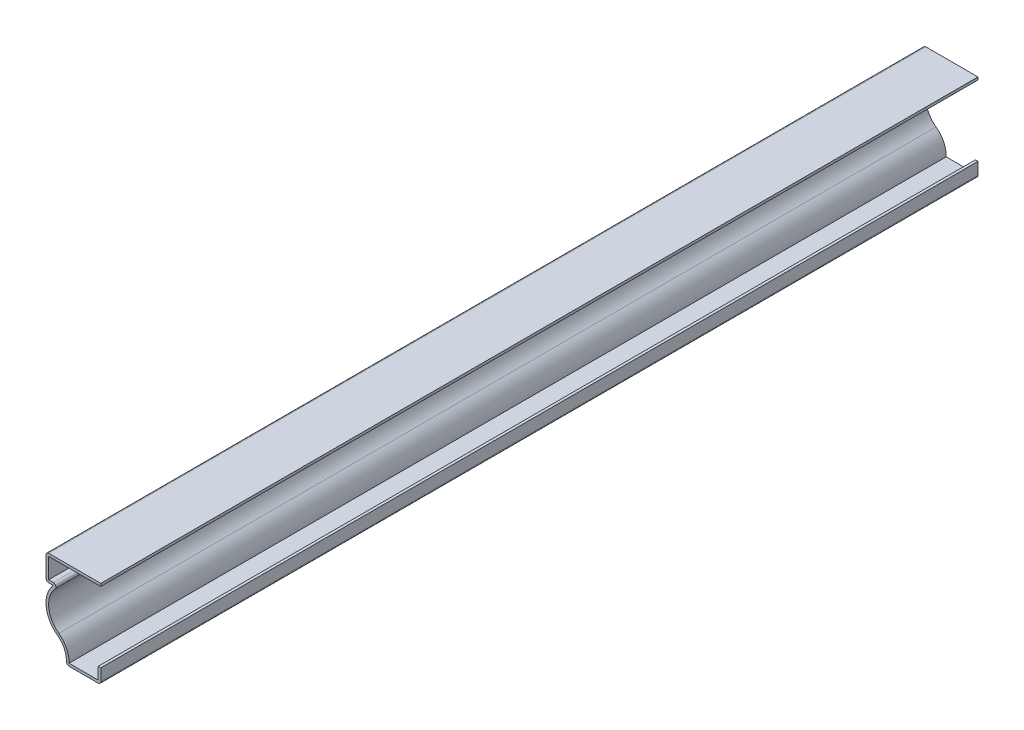
ISO-10303-21;
HEADER;
FILE_DESCRIPTION(('STEP AP214'),'2;1');
FILE_NAME('part.step','',(''),(''),'','','');
FILE_SCHEMA(('AUTOMOTIVE_DESIGN { 1 0 10303 214 1 1 1 1 }'));
ENDSEC;
DATA;
#1=APPLICATION_CONTEXT('core data for automotive mechanical design processes');
#2=APPLICATION_PROTOCOL_DEFINITION('international standard','automotive_design',2000,#1);
#3=PRODUCT_CONTEXT('',#1,'mechanical');
#4=PRODUCT('Part','Part','',(#3));
#5=PRODUCT_RELATED_PRODUCT_CATEGORY('part','',(#4));
#6=PRODUCT_DEFINITION_FORMATION('','',#4);
#7=PRODUCT_DEFINITION_CONTEXT('part definition',#1,'design');
#8=PRODUCT_DEFINITION('design','',#6,#7);
#9=PRODUCT_DEFINITION_SHAPE('','',#8);
#10=(LENGTH_UNIT() NAMED_UNIT(*) SI_UNIT(.MILLI.,.METRE.));
#11=(NAMED_UNIT(*) PLANE_ANGLE_UNIT() SI_UNIT($,.RADIAN.));
#12=(NAMED_UNIT(*) SI_UNIT($,.STERADIAN.) SOLID_ANGLE_UNIT());
#13=UNCERTAINTY_MEASURE_WITH_UNIT(LENGTH_MEASURE(1.E-05),#10,'distance_accuracy_value','');
#14=(GEOMETRIC_REPRESENTATION_CONTEXT(3) GLOBAL_UNCERTAINTY_ASSIGNED_CONTEXT((#13)) GLOBAL_UNIT_ASSIGNED_CONTEXT((#10,
#11,#12)) REPRESENTATION_CONTEXT('',''));
#15=CARTESIAN_POINT('',(0.,0.,0.));
#16=DIRECTION('',(0.,0.,1.));
#17=DIRECTION('',(1.,0.,0.));
#18=AXIS2_PLACEMENT_3D('',#15,#16,#17);
#19=CARTESIAN_POINT('',(-23.8125,36.957,-381.));
#20=DIRECTION('',(0.,-1.,0.));
#21=DIRECTION('',(0.,0.,-1.));
#22=AXIS2_PLACEMENT_3D('',#19,#20,#21);
#23=PLANE('',#22);
#24=DIRECTION('',(1.,0.,0.));
#25=VECTOR('',#24,1.);
#26=CARTESIAN_POINT('',(-23.8125,36.957,0.));
#27=LINE('',#26,#25);
#28=CARTESIAN_POINT('',(-22.6695,36.957,0.));
#29=VERTEX_POINT('',#28);
#30=CARTESIAN_POINT('',(0.,36.957,0.));
#31=VERTEX_POINT('',#30);
#32=EDGE_CURVE('E242',#29,#31,#27,.T.);
#33=ORIENTED_EDGE('',*,*,#32,.F.);
#34=DIRECTION('',(0.,0.,1.));
#35=VECTOR('',#34,1.);
#36=CARTESIAN_POINT('',(-22.6695,36.957,-381.));
#37=LINE('',#36,#35);
#38=CARTESIAN_POINT('',(-22.6695,36.957,-381.));
#39=VERTEX_POINT('',#38);
#40=EDGE_CURVE('E203',#39,#29,#37,.T.);
#41=ORIENTED_EDGE('',*,*,#40,.F.);
#42=DIRECTION('',(1.,0.,0.));
#43=VECTOR('',#42,1.);
#44=CARTESIAN_POINT('',(-23.8125,36.957,-381.));
#45=LINE('',#44,#43);
#46=CARTESIAN_POINT('',(0.,36.957,-381.));
#47=VERTEX_POINT('',#46);
#48=EDGE_CURVE('E185',#39,#47,#45,.T.);
#49=ORIENTED_EDGE('',*,*,#48,.T.);
#50=DIRECTION('',(0.,0.,1.));
#51=VECTOR('',#50,1.);
#52=CARTESIAN_POINT('',(0.,36.957,-381.));
#53=LINE('',#52,#51);
#54=EDGE_CURVE('E193',#47,#31,#53,.T.);
#55=ORIENTED_EDGE('',*,*,#54,.T.);
#56=EDGE_LOOP('',(#33,#41,#49,#55));
#57=FACE_BOUND('',#56,.T.);
#58=ADVANCED_FACE('F35',(#57),#23,.T.);
#59=CARTESIAN_POINT('',(-22.6695,26.9875,-381.));
#60=DIRECTION('',(1.,0.,0.));
#61=DIRECTION('',(0.,1.,0.));
#62=AXIS2_PLACEMENT_3D('',#59,#60,#61);
#63=PLANE('',#62);
#64=DIRECTION('',(0.,1.,0.));
#65=VECTOR('',#64,1.);
#66=CARTESIAN_POINT('',(-22.6695,26.9875,0.));
#67=LINE('',#66,#65);
#68=CARTESIAN_POINT('',(-22.6695,28.1305,0.));
#69=VERTEX_POINT('',#68);
#70=EDGE_CURVE('E204',#69,#29,#67,.T.);
#71=ORIENTED_EDGE('',*,*,#70,.F.);
#72=DIRECTION('',(0.,0.,1.));
#73=VECTOR('',#72,1.);
#74=CARTESIAN_POINT('',(-22.6695,28.1305,-381.));
#75=LINE('',#74,#73);
#76=CARTESIAN_POINT('',(-22.6695,28.1305,-381.));
#77=VERTEX_POINT('',#76);
#78=EDGE_CURVE('E279',#77,#69,#75,.T.);
#79=ORIENTED_EDGE('',*,*,#78,.F.);
#80=DIRECTION('',(0.,1.,0.));
#81=VECTOR('',#80,1.);
#82=CARTESIAN_POINT('',(-22.6695,26.9875,-381.));
#83=LINE('',#82,#81);
#84=EDGE_CURVE('E201',#77,#39,#83,.T.);
#85=ORIENTED_EDGE('',*,*,#84,.T.);
#86=ORIENTED_EDGE('',*,*,#40,.T.);
#87=EDGE_LOOP('',(#71,#79,#85,#86));
#88=FACE_BOUND('',#87,.T.);
#89=ADVANCED_FACE('F361',(#88),#63,.T.);
#90=CARTESIAN_POINT('',(-20.6375,28.1305,-381.));
#91=DIRECTION('',(0.,1.,0.));
#92=DIRECTION('',(0.,0.,1.));
#93=AXIS2_PLACEMENT_3D('',#90,#91,#92);
#94=PLANE('',#93);
#95=DIRECTION('',(1.,0.,0.));
#96=VECTOR('',#95,1.);
#97=CARTESIAN_POINT('',(-20.6375,28.1305,0.));
#98=LINE('',#97,#96);
#99=CARTESIAN_POINT('',(-20.6375,28.1305,0.));
#100=VERTEX_POINT('',#99);
#101=EDGE_CURVE('E207',#100,#69,#98,.F.);
#102=ORIENTED_EDGE('',*,*,#101,.F.);
#103=DIRECTION('',(0.,0.,1.));
#104=VECTOR('',#103,1.);
#105=CARTESIAN_POINT('',(-20.6375,28.1305,-381.));
#106=LINE('',#105,#104);
#107=CARTESIAN_POINT('',(-20.6375,28.1305,-381.));
#108=VERTEX_POINT('',#107);
#109=EDGE_CURVE('E331',#100,#108,#106,.F.);
#110=ORIENTED_EDGE('',*,*,#109,.T.);
#111=DIRECTION('',(1.,0.,0.));
#112=VECTOR('',#111,1.);
#113=CARTESIAN_POINT('',(-20.6375,28.1305,-381.));
#114=LINE('',#113,#112);
#115=EDGE_CURVE('E239',#108,#77,#114,.F.);
#116=ORIENTED_EDGE('',*,*,#115,.T.);
#117=ORIENTED_EDGE('',*,*,#78,.T.);
#118=EDGE_LOOP('',(#102,#110,#116,#117));
#119=FACE_BOUND('',#118,.T.);
#120=ADVANCED_FACE('F428',(#119),#94,.T.);
#121=CARTESIAN_POINT('',(-11.90625,18.8928065221714,-381.));
#122=DIRECTION('',(0.,0.,1.));
#123=DIRECTION('',(1.,0.,0.));
#124=AXIS2_PLACEMENT_3D('',#121,#122,#123);
#125=CYLINDRICAL_SURFACE('',#124,10.76325);
#126=CARTESIAN_POINT('',(-11.90625,18.8928065221714,-381.));
#127=DIRECTION('',(0.,0.,1.));
#128=DIRECTION('',(1.,0.,0.));
#129=AXIS2_PLACEMENT_3D('',#126,#127,#128);
#130=CIRCLE('',#129,10.76325);
#131=CARTESIAN_POINT('',(-18.2216533434014,10.1771177270931,-381.));
#132=VERTEX_POINT('',#131);
#133=CARTESIAN_POINT('',(-19.7993,26.2104094261285,-381.));
#134=VERTEX_POINT('',#133);
#135=EDGE_CURVE('E236',#132,#134,#130,.F.);
#136=ORIENTED_EDGE('',*,*,#135,.T.);
#137=DIRECTION('',(0.,0.,1.));
#138=VECTOR('',#137,1.);
#139=CARTESIAN_POINT('',(-19.7993,26.2104094261285,-381.));
#140=LINE('',#139,#138);
#141=CARTESIAN_POINT('',(-19.7993,26.2104094261285,0.));
#142=VERTEX_POINT('',#141);
#143=EDGE_CURVE('E328',#134,#142,#140,.T.);
#144=ORIENTED_EDGE('',*,*,#143,.T.);
#145=CARTESIAN_POINT('',(-11.90625,18.8928065221714,0.));
#146=DIRECTION('',(0.,0.,1.));
#147=DIRECTION('',(1.,0.,0.));
#148=AXIS2_PLACEMENT_3D('',#145,#146,#147);
#149=CIRCLE('',#148,10.76325);
#150=CARTESIAN_POINT('',(-18.2216533434014,10.1771177270931,0.));
#151=VERTEX_POINT('',#150);
#152=EDGE_CURVE('E273',#151,#142,#149,.F.);
#153=ORIENTED_EDGE('',*,*,#152,.F.);
#154=DIRECTION('',(0.,0.,1.));
#155=VECTOR('',#154,1.);
#156=CARTESIAN_POINT('',(-18.2216533434014,10.1771177270931,-381.));
#157=LINE('',#156,#155);
#158=EDGE_CURVE('E282',#132,#151,#157,.T.);
#159=ORIENTED_EDGE('',*,*,#158,.F.);
#160=EDGE_LOOP('',(#136,#144,#153,#159));
#161=FACE_BOUND('',#160,.T.);
#162=ADVANCED_FACE('F372',(#161),#125,.F.);
#163=CARTESIAN_POINT('',(-24.48116816164,1.53855892135172,-381.));
#164=DIRECTION('',(0.,0.,1.));
#165=DIRECTION('',(1.,0.,0.));
#166=AXIS2_PLACEMENT_3D('',#163,#164,#165);
#167=CYLINDRICAL_SURFACE('',#166,10.668);
#168=CARTESIAN_POINT('',(-24.48116816164,1.53855892135172,0.));
#169=DIRECTION('',(0.,0.,1.));
#170=DIRECTION('',(1.,0.,0.));
#171=AXIS2_PLACEMENT_3D('',#168,#169,#170);
#172=CIRCLE('',#171,10.668);
#173=CARTESIAN_POINT('',(-13.8205041513759,1.143,0.));
#174=VERTEX_POINT('',#173);
#175=EDGE_CURVE('E270',#174,#151,#172,.T.);
#176=ORIENTED_EDGE('',*,*,#175,.F.);
#177=DIRECTION('',(0.,0.,1.));
#178=VECTOR('',#177,1.);
#179=CARTESIAN_POINT('',(-13.8205041513759,1.143,-381.));
#180=LINE('',#179,#178);
#181=CARTESIAN_POINT('',(-13.8205041513759,1.143,-381.));
#182=VERTEX_POINT('',#181);
#183=EDGE_CURVE('E284',#182,#174,#180,.T.);
#184=ORIENTED_EDGE('',*,*,#183,.F.);
#185=CARTESIAN_POINT('',(-24.48116816164,1.53855892135172,-381.));
#186=DIRECTION('',(0.,0.,1.));
#187=DIRECTION('',(1.,0.,0.));
#188=AXIS2_PLACEMENT_3D('',#185,#186,#187);
#189=CIRCLE('',#188,10.668);
#190=EDGE_CURVE('E233',#182,#132,#189,.T.);
#191=ORIENTED_EDGE('',*,*,#190,.T.);
#192=ORIENTED_EDGE('',*,*,#158,.T.);
#193=EDGE_LOOP('',(#176,#184,#191,#192));
#194=FACE_BOUND('',#193,.T.);
#195=ADVANCED_FACE('F376',(#194),#167,.T.);
#196=CARTESIAN_POINT('',(0.,1.143,-381.));
#197=DIRECTION('',(0.,1.,0.));
#198=DIRECTION('',(-1.,0.,0.));
#199=AXIS2_PLACEMENT_3D('',#196,#197,#198);
#200=PLANE('',#199);
#201=DIRECTION('',(-1.,0.,0.));
#202=VECTOR('',#201,1.);
#203=CARTESIAN_POINT('',(0.,1.143,0.));
#204=LINE('',#203,#202);
#205=CARTESIAN_POINT('',(-1.143,1.143,0.));
#206=VERTEX_POINT('',#205);
#207=EDGE_CURVE('E267',#206,#174,#204,.T.);
#208=ORIENTED_EDGE('',*,*,#207,.F.);
#209=DIRECTION('',(0.,0.,1.));
#210=VECTOR('',#209,1.);
#211=CARTESIAN_POINT('',(-1.143,1.143,-381.));
#212=LINE('',#211,#210);
#213=CARTESIAN_POINT('',(-1.143,1.143,-381.));
#214=VERTEX_POINT('',#213);
#215=EDGE_CURVE('E286',#214,#206,#212,.T.);
#216=ORIENTED_EDGE('',*,*,#215,.F.);
#217=DIRECTION('',(-1.,0.,0.));
#218=VECTOR('',#217,1.);
#219=CARTESIAN_POINT('',(0.,1.143,-381.));
#220=LINE('',#219,#218);
#221=EDGE_CURVE('E230',#214,#182,#220,.T.);
#222=ORIENTED_EDGE('',*,*,#221,.T.);
#223=ORIENTED_EDGE('',*,*,#183,.T.);
#224=EDGE_LOOP('',(#208,#216,#222,#223));
#225=FACE_BOUND('',#224,.T.);
#226=ADVANCED_FACE('F381',(#225),#200,.T.);
#227=CARTESIAN_POINT('',(-1.143,6.35,-381.));
#228=DIRECTION('',(-1.,0.,0.));
#229=DIRECTION('',(0.,-1.,0.));
#230=AXIS2_PLACEMENT_3D('',#227,#228,#229);
#231=PLANE('',#230);
#232=DIRECTION('',(0.,-1.,0.));
#233=VECTOR('',#232,1.);
#234=CARTESIAN_POINT('',(-1.143,6.35,0.));
#235=LINE('',#234,#233);
#236=CARTESIAN_POINT('',(-1.143,6.35,0.));
#237=VERTEX_POINT('',#236);
#238=EDGE_CURVE('E264',#237,#206,#235,.T.);
#239=ORIENTED_EDGE('',*,*,#238,.F.);
#240=DIRECTION('',(0.,0.,1.));
#241=VECTOR('',#240,1.);
#242=CARTESIAN_POINT('',(-1.143,6.35,-381.));
#243=LINE('',#242,#241);
#244=CARTESIAN_POINT('',(-1.143,6.35,-381.));
#245=VERTEX_POINT('',#244);
#246=EDGE_CURVE('E288',#245,#237,#243,.T.);
#247=ORIENTED_EDGE('',*,*,#246,.F.);
#248=DIRECTION('',(0.,-1.,0.));
#249=VECTOR('',#248,1.);
#250=CARTESIAN_POINT('',(-1.143,6.35,-381.));
#251=LINE('',#250,#249);
#252=EDGE_CURVE('E227',#245,#214,#251,.T.);
#253=ORIENTED_EDGE('',*,*,#252,.T.);
#254=ORIENTED_EDGE('',*,*,#215,.T.);
#255=EDGE_LOOP('',(#239,#247,#253,#254));
#256=FACE_BOUND('',#255,.T.);
#257=ADVANCED_FACE('F384',(#256),#231,.T.);
#258=CARTESIAN_POINT('',(-1.143,6.35,-381.));
#259=DIRECTION('',(0.,-1.,0.));
#260=DIRECTION('',(0.,0.,-1.));
#261=AXIS2_PLACEMENT_3D('',#258,#259,#260);
#262=PLANE('',#261);
#263=DIRECTION('',(1.,0.,0.));
#264=VECTOR('',#263,1.);
#265=CARTESIAN_POINT('',(-1.143,6.35,0.));
#266=LINE('',#265,#264);
#267=CARTESIAN_POINT('',(0.,6.35,0.));
#268=VERTEX_POINT('',#267);
#269=EDGE_CURVE('E262',#237,#268,#266,.T.);
#270=ORIENTED_EDGE('',*,*,#269,.T.);
#271=DIRECTION('',(0.,0.,1.));
#272=VECTOR('',#271,1.);
#273=CARTESIAN_POINT('',(0.,6.35,-381.));
#274=LINE('',#273,#272);
#275=CARTESIAN_POINT('',(0.,6.35,-381.));
#276=VERTEX_POINT('',#275);
#277=EDGE_CURVE('E290',#276,#268,#274,.T.);
#278=ORIENTED_EDGE('',*,*,#277,.F.);
#279=DIRECTION('',(1.,0.,0.));
#280=VECTOR('',#279,1.);
#281=CARTESIAN_POINT('',(-1.143,6.35,-381.));
#282=LINE('',#281,#280);
#283=EDGE_CURVE('E225',#245,#276,#282,.T.);
#284=ORIENTED_EDGE('',*,*,#283,.F.);
#285=ORIENTED_EDGE('',*,*,#246,.T.);
#286=EDGE_LOOP('',(#270,#278,#284,#285));
#287=FACE_BOUND('',#286,.T.);
#288=ADVANCED_FACE('F390',(#287),#262,.F.);
#289=CARTESIAN_POINT('',(0.,6.35,-381.));
#290=DIRECTION('',(-1.,0.,0.));
#291=DIRECTION('',(0.,-1.,0.));
#292=AXIS2_PLACEMENT_3D('',#289,#290,#291);
#293=PLANE('',#292);
#294=DIRECTION('',(0.,-1.,0.));
#295=VECTOR('',#294,1.);
#296=CARTESIAN_POINT('',(0.,6.35,0.));
#297=LINE('',#296,#295);
#298=CARTESIAN_POINT('',(0.,1.143,0.));
#299=VERTEX_POINT('',#298);
#300=EDGE_CURVE('E259',#268,#299,#297,.T.);
#301=ORIENTED_EDGE('',*,*,#300,.T.);
#302=DIRECTION('',(0.,0.,1.));
#303=VECTOR('',#302,1.);
#304=CARTESIAN_POINT('',(0.,1.143,-381.));
#305=LINE('',#304,#303);
#306=CARTESIAN_POINT('',(0.,1.143,-381.));
#307=VERTEX_POINT('',#306);
#308=EDGE_CURVE('E314',#299,#307,#305,.F.);
#309=ORIENTED_EDGE('',*,*,#308,.T.);
#310=DIRECTION('',(0.,-1.,0.));
#311=VECTOR('',#310,1.);
#312=CARTESIAN_POINT('',(0.,6.35,-381.));
#313=LINE('',#312,#311);
#314=EDGE_CURVE('E223',#276,#307,#313,.T.);
#315=ORIENTED_EDGE('',*,*,#314,.F.);
#316=ORIENTED_EDGE('',*,*,#277,.T.);
#317=EDGE_LOOP('',(#301,#309,#315,#316));
#318=FACE_BOUND('',#317,.T.);
#319=ADVANCED_FACE('F394',(#318),#293,.F.);
#320=CARTESIAN_POINT('',(0.,0.,-381.));
#321=DIRECTION('',(0.,1.,0.));
#322=DIRECTION('',(-1.,0.,0.));
#323=AXIS2_PLACEMENT_3D('',#320,#321,#322);
#324=PLANE('',#323);
#325=DIRECTION('',(-1.,0.,0.));
#326=VECTOR('',#325,1.);
#327=CARTESIAN_POINT('',(0.,0.,-381.));
#328=LINE('',#327,#326);
#329=CARTESIAN_POINT('',(-1.143,0.,-381.));
#330=VERTEX_POINT('',#329);
#331=CARTESIAN_POINT('',(-13.8205041513759,0.,-381.));
#332=VERTEX_POINT('',#331);
#333=EDGE_CURVE('E220',#330,#332,#328,.T.);
#334=ORIENTED_EDGE('',*,*,#333,.F.);
#335=DIRECTION('',(0.,0.,1.));
#336=VECTOR('',#335,1.);
#337=CARTESIAN_POINT('',(-1.143,0.,-381.));
#338=LINE('',#337,#336);
#339=CARTESIAN_POINT('',(-1.143,0.,0.));
#340=VERTEX_POINT('',#339);
#341=EDGE_CURVE('E301',#330,#340,#338,.T.);
#342=ORIENTED_EDGE('',*,*,#341,.T.);
#343=DIRECTION('',(-1.,0.,0.));
#344=VECTOR('',#343,1.);
#345=CARTESIAN_POINT('',(0.,0.,0.));
#346=LINE('',#345,#344);
#347=CARTESIAN_POINT('',(-13.8205041513759,0.,0.));
#348=VERTEX_POINT('',#347);
#349=EDGE_CURVE('E256',#340,#348,#346,.T.);
#350=ORIENTED_EDGE('',*,*,#349,.T.);
#351=DIRECTION('',(0.,0.,1.));
#352=VECTOR('',#351,1.);
#353=CARTESIAN_POINT('',(-13.8205041513759,0.,-381.));
#354=LINE('',#353,#352);
#355=EDGE_CURVE('E278',#348,#332,#354,.F.);
#356=ORIENTED_EDGE('',*,*,#355,.T.);
#357=EDGE_LOOP('',(#334,#342,#350,#356));
#358=FACE_BOUND('',#357,.T.);
#359=ADVANCED_FACE('F402',(#358),#324,.F.);
#360=CARTESIAN_POINT('',(-24.48116816164,1.53855892135172,-381.));
#361=DIRECTION('',(0.,0.,1.));
#362=DIRECTION('',(1.,0.,0.));
#363=AXIS2_PLACEMENT_3D('',#360,#361,#362);
#364=CYLINDRICAL_SURFACE('',#363,9.525);
#365=CARTESIAN_POINT('',(-24.48116816164,1.53855892135172,-381.));
#366=DIRECTION('',(0.,0.,1.));
#367=DIRECTION('',(1.,0.,0.));
#368=AXIS2_PLACEMENT_3D('',#365,#366,#367);
#369=CIRCLE('',#368,9.525);
#370=CARTESIAN_POINT('',(-14.9627181524756,1.18538131300197,-381.));
#371=VERTEX_POINT('',#370);
#372=CARTESIAN_POINT('',(-18.8923156453555,9.25155785504938,-381.));
#373=VERTEX_POINT('',#372);
#374=EDGE_CURVE('E218',#371,#373,#369,.T.);
#375=ORIENTED_EDGE('',*,*,#374,.F.);
#376=DIRECTION('',(0.,0.,1.));
#377=VECTOR('',#376,1.);
#378=CARTESIAN_POINT('',(-14.9627181524756,1.18538131300197,-381.));
#379=LINE('',#378,#377);
#380=CARTESIAN_POINT('',(-14.9627181524756,1.18538131300197,0.));
#381=VERTEX_POINT('',#380);
#382=EDGE_CURVE('E325',#371,#381,#379,.T.);
#383=ORIENTED_EDGE('',*,*,#382,.T.);
#384=CARTESIAN_POINT('',(-24.48116816164,1.53855892135172,0.));
#385=DIRECTION('',(0.,0.,1.));
#386=DIRECTION('',(1.,0.,0.));
#387=AXIS2_PLACEMENT_3D('',#384,#385,#386);
#388=CIRCLE('',#387,9.525);
#389=CARTESIAN_POINT('',(-18.8923156453555,9.25155785504938,0.));
#390=VERTEX_POINT('',#389);
#391=EDGE_CURVE('E254',#381,#390,#388,.T.);
#392=ORIENTED_EDGE('',*,*,#391,.T.);
#393=DIRECTION('',(0.,0.,1.));
#394=VECTOR('',#393,1.);
#395=CARTESIAN_POINT('',(-18.8923156453555,9.25155785504938,-381.));
#396=LINE('',#395,#394);
#397=EDGE_CURVE('E293',#373,#390,#396,.T.);
#398=ORIENTED_EDGE('',*,*,#397,.F.);
#399=EDGE_LOOP('',(#375,#383,#392,#398));
#400=FACE_BOUND('',#399,.T.);
#401=ADVANCED_FACE('F410',(#400),#364,.F.);
#402=CARTESIAN_POINT('',(-11.90625,18.8928065221714,-381.));
#403=DIRECTION('',(0.,0.,1.));
#404=DIRECTION('',(1.,0.,0.));
#405=AXIS2_PLACEMENT_3D('',#402,#403,#404);
#406=CYLINDRICAL_SURFACE('',#405,11.90625);
#407=CARTESIAN_POINT('',(-11.90625,18.8928065221714,0.));
#408=DIRECTION('',(0.,0.,-1.));
#409=DIRECTION('',(-1.,0.,0.));
#410=AXIS2_PLACEMENT_3D('',#407,#408,#409);
#411=CIRCLE('',#410,11.90625);
#412=CARTESIAN_POINT('',(-20.6375,26.9875,0.));
#413=VERTEX_POINT('',#412);
#414=EDGE_CURVE('E252',#390,#413,#411,.T.);
#415=ORIENTED_EDGE('',*,*,#414,.T.);
#416=DIRECTION('',(0.,0.,1.));
#417=VECTOR('',#416,1.);
#418=CARTESIAN_POINT('',(-20.6375,26.9875,-381.));
#419=LINE('',#418,#417);
#420=CARTESIAN_POINT('',(-20.6375,26.9875,-381.));
#421=VERTEX_POINT('',#420);
#422=EDGE_CURVE('E296',#421,#413,#419,.T.);
#423=ORIENTED_EDGE('',*,*,#422,.F.);
#424=CARTESIAN_POINT('',(-11.90625,18.8928065221714,-381.));
#425=DIRECTION('',(0.,0.,-1.));
#426=DIRECTION('',(-1.,0.,0.));
#427=AXIS2_PLACEMENT_3D('',#424,#425,#426);
#428=CIRCLE('',#427,11.90625);
#429=EDGE_CURVE('E216',#373,#421,#428,.T.);
#430=ORIENTED_EDGE('',*,*,#429,.F.);
#431=ORIENTED_EDGE('',*,*,#397,.T.);
#432=EDGE_LOOP('',(#415,#423,#430,#431));
#433=FACE_BOUND('',#432,.T.);
#434=ADVANCED_FACE('F414',(#433),#406,.T.);
#435=CARTESIAN_POINT('',(-20.6375,26.9875,-381.));
#436=DIRECTION('',(0.,1.,0.));
#437=DIRECTION('',(0.,0.,1.));
#438=AXIS2_PLACEMENT_3D('',#435,#436,#437);
#439=PLANE('',#438);
#440=DIRECTION('',(-1.,0.,0.));
#441=VECTOR('',#440,1.);
#442=CARTESIAN_POINT('',(-20.6375,26.9875,0.));
#443=LINE('',#442,#441);
#444=CARTESIAN_POINT('',(-22.6695,26.9875,0.));
#445=VERTEX_POINT('',#444);
#446=EDGE_CURVE('E249',#413,#445,#443,.T.);
#447=ORIENTED_EDGE('',*,*,#446,.T.);
#448=DIRECTION('',(0.,0.,1.));
#449=VECTOR('',#448,1.);
#450=CARTESIAN_POINT('',(-22.6695,26.9875,-381.));
#451=LINE('',#450,#449);
#452=CARTESIAN_POINT('',(-22.6695,26.9875,-381.));
#453=VERTEX_POINT('',#452);
#454=EDGE_CURVE('E43',#445,#453,#451,.F.);
#455=ORIENTED_EDGE('',*,*,#454,.T.);
#456=DIRECTION('',(-1.,0.,0.));
#457=VECTOR('',#456,1.);
#458=CARTESIAN_POINT('',(-20.6375,26.9875,-381.));
#459=LINE('',#458,#457);
#460=EDGE_CURVE('E213',#421,#453,#459,.T.);
#461=ORIENTED_EDGE('',*,*,#460,.F.);
#462=ORIENTED_EDGE('',*,*,#422,.T.);
#463=EDGE_LOOP('',(#447,#455,#461,#462));
#464=FACE_BOUND('',#463,.T.);
#465=ADVANCED_FACE('F339',(#464),#439,.F.);
#466=CARTESIAN_POINT('',(-23.8125,26.9875,-381.));
#467=DIRECTION('',(1.,0.,0.));
#468=DIRECTION('',(0.,1.,0.));
#469=AXIS2_PLACEMENT_3D('',#466,#467,#468);
#470=PLANE('',#469);
#471=DIRECTION('',(0.,1.,0.));
#472=VECTOR('',#471,1.);
#473=CARTESIAN_POINT('',(-23.8125,26.9875,-381.));
#474=LINE('',#473,#472);
#475=CARTESIAN_POINT('',(-23.8125,28.1305,-381.));
#476=VERTEX_POINT('',#475);
#477=CARTESIAN_POINT('',(-23.8125,36.957,-381.));
#478=VERTEX_POINT('',#477);
#479=EDGE_CURVE('E211',#476,#478,#474,.T.);
#480=ORIENTED_EDGE('',*,*,#479,.F.);
#481=DIRECTION('',(0.,0.,1.));
#482=VECTOR('',#481,1.);
#483=CARTESIAN_POINT('',(-23.8125,28.1305,-381.));
#484=LINE('',#483,#482);
#485=CARTESIAN_POINT('',(-23.8125,28.1305,0.));
#486=VERTEX_POINT('',#485);
#487=EDGE_CURVE('E334',#476,#486,#484,.T.);
#488=ORIENTED_EDGE('',*,*,#487,.T.);
#489=DIRECTION('',(0.,1.,0.));
#490=VECTOR('',#489,1.);
#491=CARTESIAN_POINT('',(-23.8125,26.9875,0.));
#492=LINE('',#491,#490);
#493=CARTESIAN_POINT('',(-23.8125,36.957,0.));
#494=VERTEX_POINT('',#493);
#495=EDGE_CURVE('E247',#486,#494,#492,.T.);
#496=ORIENTED_EDGE('',*,*,#495,.T.);
#497=DIRECTION('',(0.,0.,1.));
#498=VECTOR('',#497,1.);
#499=CARTESIAN_POINT('',(-23.8125,36.957,-381.));
#500=LINE('',#499,#498);
#501=EDGE_CURVE('E58',#494,#478,#500,.F.);
#502=ORIENTED_EDGE('',*,*,#501,.T.);
#503=EDGE_LOOP('',(#480,#488,#496,#502));
#504=FACE_BOUND('',#503,.T.);
#505=ADVANCED_FACE('F348',(#504),#470,.F.);
#506=CARTESIAN_POINT('',(-23.8125,38.1,-381.));
#507=DIRECTION('',(0.,-1.,0.));
#508=DIRECTION('',(0.,0.,-1.));
#509=AXIS2_PLACEMENT_3D('',#506,#507,#508);
#510=PLANE('',#509);
#511=DIRECTION('',(1.,0.,0.));
#512=VECTOR('',#511,1.);
#513=CARTESIAN_POINT('',(-23.8125,38.1,-381.));
#514=LINE('',#513,#512);
#515=CARTESIAN_POINT('',(-22.6695,38.1,-381.));
#516=VERTEX_POINT('',#515);
#517=CARTESIAN_POINT('',(0.,38.1,-381.));
#518=VERTEX_POINT('',#517);
#519=EDGE_CURVE('E187',#516,#518,#514,.T.);
#520=ORIENTED_EDGE('',*,*,#519,.F.);
#521=DIRECTION('',(0.,0.,1.));
#522=VECTOR('',#521,1.);
#523=CARTESIAN_POINT('',(-22.6695,38.1,-381.));
#524=LINE('',#523,#522);
#525=CARTESIAN_POINT('',(-22.6695,38.1,0.));
#526=VERTEX_POINT('',#525);
#527=EDGE_CURVE('E11',#516,#526,#524,.T.);
#528=ORIENTED_EDGE('',*,*,#527,.T.);
#529=DIRECTION('',(1.,0.,0.));
#530=VECTOR('',#529,1.);
#531=CARTESIAN_POINT('',(-23.8125,38.1,0.));
#532=LINE('',#531,#530);
#533=CARTESIAN_POINT('',(0.,38.1,0.));
#534=VERTEX_POINT('',#533);
#535=EDGE_CURVE('E245',#526,#534,#532,.T.);
#536=ORIENTED_EDGE('',*,*,#535,.T.);
#537=DIRECTION('',(0.,0.,1.));
#538=VECTOR('',#537,1.);
#539=CARTESIAN_POINT('',(0.,38.1,-381.));
#540=LINE('',#539,#538);
#541=EDGE_CURVE('E200',#518,#534,#540,.T.);
#542=ORIENTED_EDGE('',*,*,#541,.F.);
#543=EDGE_LOOP('',(#520,#528,#536,#542));
#544=FACE_BOUND('',#543,.T.);
#545=ADVANCED_FACE('F356',(#544),#510,.F.);
#546=CARTESIAN_POINT('',(0.,38.1,-381.));
#547=DIRECTION('',(-1.,0.,0.));
#548=DIRECTION('',(0.,0.,1.));
#549=AXIS2_PLACEMENT_3D('',#546,#547,#548);
#550=PLANE('',#549);
#551=DIRECTION('',(0.,-1.,0.));
#552=VECTOR('',#551,1.);
#553=CARTESIAN_POINT('',(0.,38.1,0.));
#554=LINE('',#553,#552);
#555=EDGE_CURVE('E196',#534,#31,#554,.T.);
#556=ORIENTED_EDGE('',*,*,#555,.T.);
#557=ORIENTED_EDGE('',*,*,#54,.F.);
#558=DIRECTION('',(0.,-1.,0.));
#559=VECTOR('',#558,1.);
#560=CARTESIAN_POINT('',(0.,38.1,-381.));
#561=LINE('',#560,#559);
#562=EDGE_CURVE('E179',#518,#47,#561,.T.);
#563=ORIENTED_EDGE('',*,*,#562,.F.);
#564=ORIENTED_EDGE('',*,*,#541,.T.);
#565=EDGE_LOOP('',(#556,#557,#563,#564));
#566=FACE_BOUND('',#565,.T.);
#567=ADVANCED_FACE('F194',(#566),#550,.F.);
#568=CARTESIAN_POINT('',(-11.90625,18.8928065221714,-381.));
#569=DIRECTION('',(0.,0.,-1.));
#570=DIRECTION('',(-1.,0.,0.));
#571=AXIS2_PLACEMENT_3D('',#568,#569,#570);
#572=PLANE('',#571);
#573=ORIENTED_EDGE('',*,*,#314,.T.);
#574=CARTESIAN_POINT('',(-1.143,1.143,-381.));
#575=DIRECTION('',(0.,0.,-1.));
#576=DIRECTION('',(-1.,0.,0.));
#577=AXIS2_PLACEMENT_3D('',#574,#575,#576);
#578=CIRCLE('',#577,1.143);
#579=EDGE_CURVE('E323',#307,#330,#578,.T.);
#580=ORIENTED_EDGE('',*,*,#579,.T.);
#581=ORIENTED_EDGE('',*,*,#333,.T.);
#582=CARTESIAN_POINT('',(-13.8205041513759,1.143,-381.));
#583=DIRECTION('',(0.,0.,-1.));
#584=DIRECTION('',(-1.,0.,0.));
#585=AXIS2_PLACEMENT_3D('',#582,#583,#584);
#586=CIRCLE('',#585,1.143);
#587=EDGE_CURVE('E321',#332,#371,#586,.T.);
#588=ORIENTED_EDGE('',*,*,#587,.T.);
#589=ORIENTED_EDGE('',*,*,#374,.T.);
#590=ORIENTED_EDGE('',*,*,#429,.T.);
#591=ORIENTED_EDGE('',*,*,#460,.T.);
#592=CARTESIAN_POINT('',(-22.6695,28.1305,-381.));
#593=DIRECTION('',(0.,0.,-1.));
#594=DIRECTION('',(-1.,0.,0.));
#595=AXIS2_PLACEMENT_3D('',#592,#593,#594);
#596=CIRCLE('',#595,1.143);
#597=EDGE_CURVE('E317',#453,#476,#596,.T.);
#598=ORIENTED_EDGE('',*,*,#597,.T.);
#599=ORIENTED_EDGE('',*,*,#479,.T.);
#600=CARTESIAN_POINT('',(-22.6695,36.957,-381.));
#601=DIRECTION('',(0.,0.,-1.));
#602=DIRECTION('',(-1.,0.,0.));
#603=AXIS2_PLACEMENT_3D('',#600,#601,#602);
#604=CIRCLE('',#603,1.143);
#605=EDGE_CURVE('E50',#478,#516,#604,.T.);
#606=ORIENTED_EDGE('',*,*,#605,.T.);
#607=ORIENTED_EDGE('',*,*,#519,.T.);
#608=ORIENTED_EDGE('',*,*,#562,.T.);
#609=ORIENTED_EDGE('',*,*,#48,.F.);
#610=ORIENTED_EDGE('',*,*,#84,.F.);
#611=ORIENTED_EDGE('',*,*,#115,.F.);
#612=CARTESIAN_POINT('',(-20.6375,26.9875,-381.));
#613=DIRECTION('',(0.,0.,-1.));
#614=DIRECTION('',(-1.,0.,0.));
#615=AXIS2_PLACEMENT_3D('',#612,#613,#614);
#616=CIRCLE('',#615,1.143);
#617=EDGE_CURVE('E319',#108,#134,#616,.T.);
#618=ORIENTED_EDGE('',*,*,#617,.T.);
#619=ORIENTED_EDGE('',*,*,#135,.F.);
#620=ORIENTED_EDGE('',*,*,#190,.F.);
#621=ORIENTED_EDGE('',*,*,#221,.F.);
#622=ORIENTED_EDGE('',*,*,#252,.F.);
#623=ORIENTED_EDGE('',*,*,#283,.T.);
#624=EDGE_LOOP('',(#573,#580,#581,#588,#589,#590,#591,#598,#599,#606,#607,#608,#609,#610,#611,
#618,#619,#620,#621,#622,#623));
#625=FACE_BOUND('',#624,.T.);
#626=ADVANCED_FACE('F182',(#625),#572,.T.);
#627=CARTESIAN_POINT('',(-11.90625,18.8928065221714,0.));
#628=DIRECTION('',(0.,0.,-1.));
#629=DIRECTION('',(-1.,0.,0.));
#630=AXIS2_PLACEMENT_3D('',#627,#628,#629);
#631=PLANE('',#630);
#632=ORIENTED_EDGE('',*,*,#349,.F.);
#633=CARTESIAN_POINT('',(-1.143,1.143,0.));
#634=DIRECTION('',(0.,0.,-1.));
#635=DIRECTION('',(-1.,0.,0.));
#636=AXIS2_PLACEMENT_3D('',#633,#634,#635);
#637=CIRCLE('',#636,1.143);
#638=EDGE_CURVE('E312',#340,#299,#637,.F.);
#639=ORIENTED_EDGE('',*,*,#638,.T.);
#640=ORIENTED_EDGE('',*,*,#300,.F.);
#641=ORIENTED_EDGE('',*,*,#269,.F.);
#642=ORIENTED_EDGE('',*,*,#238,.T.);
#643=ORIENTED_EDGE('',*,*,#207,.T.);
#644=ORIENTED_EDGE('',*,*,#175,.T.);
#645=ORIENTED_EDGE('',*,*,#152,.T.);
#646=CARTESIAN_POINT('',(-20.6375,26.9875,0.));
#647=DIRECTION('',(0.,0.,-1.));
#648=DIRECTION('',(-1.,0.,0.));
#649=AXIS2_PLACEMENT_3D('',#646,#647,#648);
#650=CIRCLE('',#649,1.143);
#651=EDGE_CURVE('E308',#142,#100,#650,.F.);
#652=ORIENTED_EDGE('',*,*,#651,.T.);
#653=ORIENTED_EDGE('',*,*,#101,.T.);
#654=ORIENTED_EDGE('',*,*,#70,.T.);
#655=ORIENTED_EDGE('',*,*,#32,.T.);
#656=ORIENTED_EDGE('',*,*,#555,.F.);
#657=ORIENTED_EDGE('',*,*,#535,.F.);
#658=CARTESIAN_POINT('',(-22.6695,36.957,0.));
#659=DIRECTION('',(0.,0.,-1.));
#660=DIRECTION('',(-1.,0.,0.));
#661=AXIS2_PLACEMENT_3D('',#658,#659,#660);
#662=CIRCLE('',#661,1.143);
#663=EDGE_CURVE('E304',#526,#494,#662,.F.);
#664=ORIENTED_EDGE('',*,*,#663,.T.);
#665=ORIENTED_EDGE('',*,*,#495,.F.);
#666=CARTESIAN_POINT('',(-22.6695,28.1305,0.));
#667=DIRECTION('',(0.,0.,-1.));
#668=DIRECTION('',(-1.,0.,0.));
#669=AXIS2_PLACEMENT_3D('',#666,#667,#668);
#670=CIRCLE('',#669,1.143);
#671=EDGE_CURVE('E306',#486,#445,#670,.F.);
#672=ORIENTED_EDGE('',*,*,#671,.T.);
#673=ORIENTED_EDGE('',*,*,#446,.F.);
#674=ORIENTED_EDGE('',*,*,#414,.F.);
#675=ORIENTED_EDGE('',*,*,#391,.F.);
#676=CARTESIAN_POINT('',(-13.8205041513759,1.143,0.));
#677=DIRECTION('',(0.,0.,-1.));
#678=DIRECTION('',(-1.,0.,0.));
#679=AXIS2_PLACEMENT_3D('',#676,#677,#678);
#680=CIRCLE('',#679,1.143);
#681=EDGE_CURVE('E310',#381,#348,#680,.F.);
#682=ORIENTED_EDGE('',*,*,#681,.T.);
#683=EDGE_LOOP('',(#632,#639,#640,#641,#642,#643,#644,#645,#652,#653,#654,#655,#656,#657,#664,
#665,#672,#673,#674,#675,#682));
#684=FACE_BOUND('',#683,.T.);
#685=ADVANCED_FACE('F351',(#684),#631,.F.);
#686=CARTESIAN_POINT('',(-1.143,1.143,-381.));
#687=DIRECTION('',(0.,0.,1.));
#688=DIRECTION('',(1.,0.,0.));
#689=AXIS2_PLACEMENT_3D('',#686,#687,#688);
#690=CYLINDRICAL_SURFACE('',#689,1.143);
#691=ORIENTED_EDGE('',*,*,#579,.F.);
#692=ORIENTED_EDGE('',*,*,#308,.F.);
#693=ORIENTED_EDGE('',*,*,#638,.F.);
#694=ORIENTED_EDGE('',*,*,#341,.F.);
#695=EDGE_LOOP('',(#691,#692,#693,#694));
#696=FACE_BOUND('',#695,.T.);
#697=ADVANCED_FACE('F397',(#696),#690,.T.);
#698=CARTESIAN_POINT('',(-13.8205041513759,1.143,-381.));
#699=DIRECTION('',(0.,0.,1.));
#700=DIRECTION('',(1.,0.,0.));
#701=AXIS2_PLACEMENT_3D('',#698,#699,#700);
#702=CYLINDRICAL_SURFACE('',#701,1.143);
#703=ORIENTED_EDGE('',*,*,#587,.F.);
#704=ORIENTED_EDGE('',*,*,#355,.F.);
#705=ORIENTED_EDGE('',*,*,#681,.F.);
#706=ORIENTED_EDGE('',*,*,#382,.F.);
#707=EDGE_LOOP('',(#703,#704,#705,#706));
#708=FACE_BOUND('',#707,.T.);
#709=ADVANCED_FACE('F405',(#708),#702,.T.);
#710=CARTESIAN_POINT('',(-20.6375,26.9875,-381.));
#711=DIRECTION('',(0.,0.,1.));
#712=DIRECTION('',(1.,0.,0.));
#713=AXIS2_PLACEMENT_3D('',#710,#711,#712);
#714=CYLINDRICAL_SURFACE('',#713,1.143);
#715=ORIENTED_EDGE('',*,*,#617,.F.);
#716=ORIENTED_EDGE('',*,*,#109,.F.);
#717=ORIENTED_EDGE('',*,*,#651,.F.);
#718=ORIENTED_EDGE('',*,*,#143,.F.);
#719=EDGE_LOOP('',(#715,#716,#717,#718));
#720=FACE_BOUND('',#719,.T.);
#721=ADVANCED_FACE('F369',(#720),#714,.T.);
#722=CARTESIAN_POINT('',(-22.6695,28.1305,-381.));
#723=DIRECTION('',(0.,0.,1.));
#724=DIRECTION('',(1.,0.,0.));
#725=AXIS2_PLACEMENT_3D('',#722,#723,#724);
#726=CYLINDRICAL_SURFACE('',#725,1.143);
#727=ORIENTED_EDGE('',*,*,#597,.F.);
#728=ORIENTED_EDGE('',*,*,#454,.F.);
#729=ORIENTED_EDGE('',*,*,#671,.F.);
#730=ORIENTED_EDGE('',*,*,#487,.F.);
#731=EDGE_LOOP('',(#727,#728,#729,#730));
#732=FACE_BOUND('',#731,.T.);
#733=ADVANCED_FACE('F346',(#732),#726,.T.);
#734=CARTESIAN_POINT('',(-22.6695,36.957,-381.));
#735=DIRECTION('',(0.,0.,1.));
#736=DIRECTION('',(1.,0.,0.));
#737=AXIS2_PLACEMENT_3D('',#734,#735,#736);
#738=CYLINDRICAL_SURFACE('',#737,1.143);
#739=ORIENTED_EDGE('',*,*,#605,.F.);
#740=ORIENTED_EDGE('',*,*,#501,.F.);
#741=ORIENTED_EDGE('',*,*,#663,.F.);
#742=ORIENTED_EDGE('',*,*,#527,.F.);
#743=EDGE_LOOP('',(#739,#740,#741,#742));
#744=FACE_BOUND('',#743,.T.);
#745=ADVANCED_FACE('F37',(#744),#738,.T.);
#746=CLOSED_SHELL('',(#58,#89,#120,#162,#195,#226,#257,#288,#319,#359,#401,#434,#465,#505,#545,
#567,#626,#685,#697,#709,#721,#733,#745));
#747=MANIFOLD_SOLID_BREP('B2',#746);
#748=ADVANCED_BREP_SHAPE_REPRESENTATION('',(#18,#747),#14);
#749=SHAPE_DEFINITION_REPRESENTATION(#9,#748);
ENDSEC;
END-ISO-10303-21;
